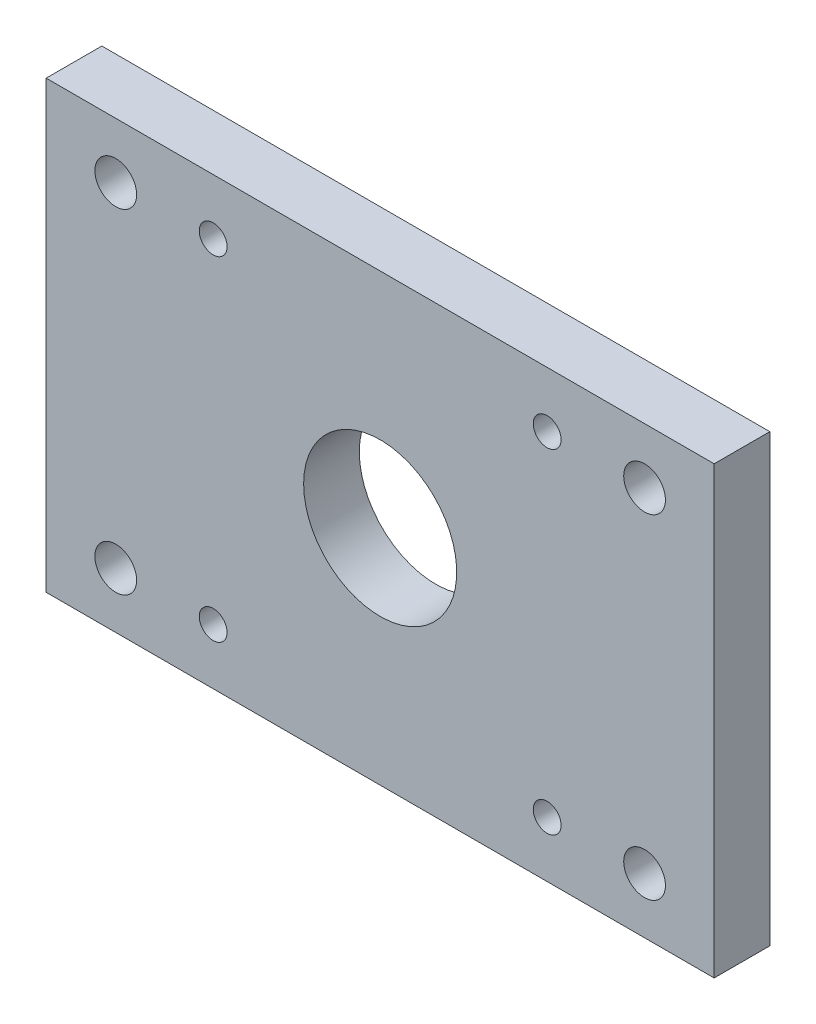
ISO-10303-21;
HEADER;
FILE_DESCRIPTION(('STEP AP214'),'2;1');
FILE_NAME('part.step','',(''),(''),'','','');
FILE_SCHEMA(('AUTOMOTIVE_DESIGN { 1 0 10303 214 1 1 1 1 }'));
ENDSEC;
DATA;
#1=APPLICATION_CONTEXT('core data for automotive mechanical design processes');
#2=APPLICATION_PROTOCOL_DEFINITION('international standard','automotive_design',2000,#1);
#3=PRODUCT_CONTEXT('',#1,'mechanical');
#4=PRODUCT('Part','Part','',(#3));
#5=PRODUCT_RELATED_PRODUCT_CATEGORY('part','',(#4));
#6=PRODUCT_DEFINITION_FORMATION('','',#4);
#7=PRODUCT_DEFINITION_CONTEXT('part definition',#1,'design');
#8=PRODUCT_DEFINITION('design','',#6,#7);
#9=PRODUCT_DEFINITION_SHAPE('','',#8);
#10=(LENGTH_UNIT() NAMED_UNIT(*) SI_UNIT(.MILLI.,.METRE.));
#11=(NAMED_UNIT(*) PLANE_ANGLE_UNIT() SI_UNIT($,.RADIAN.));
#12=(NAMED_UNIT(*) SI_UNIT($,.STERADIAN.) SOLID_ANGLE_UNIT());
#13=UNCERTAINTY_MEASURE_WITH_UNIT(LENGTH_MEASURE(1.E-05),#10,'distance_accuracy_value','');
#14=(GEOMETRIC_REPRESENTATION_CONTEXT(3) GLOBAL_UNCERTAINTY_ASSIGNED_CONTEXT((#13)) GLOBAL_UNIT_ASSIGNED_CONTEXT((#10,
#11,#12)) REPRESENTATION_CONTEXT('',''));
#15=CARTESIAN_POINT('',(0.,0.,0.));
#16=DIRECTION('',(0.,0.,1.));
#17=DIRECTION('',(1.,0.,0.));
#18=AXIS2_PLACEMENT_3D('',#15,#16,#17);
#19=CARTESIAN_POINT('',(0.,50.8,6.35));
#20=DIRECTION('',(0.,0.,-1.));
#21=DIRECTION('',(-1.,0.,0.));
#22=AXIS2_PLACEMENT_3D('',#19,#20,#21);
#23=PLANE('',#22);
#24=CARTESIAN_POINT('',(57.150000000001,6.35000000000008,6.35));
#25=DIRECTION('',(0.,0.,-1.));
#26=DIRECTION('',(-1.,0.,0.));
#27=AXIS2_PLACEMENT_3D('',#24,#25,#26);
#28=CIRCLE('',#27,1.5875);
#29=CARTESIAN_POINT('',(55.562500000001,6.35000000000008,6.35));
#30=VERTEX_POINT('',#29);
#31=EDGE_CURVE('E159',#30,#30,#28,.T.);
#32=ORIENTED_EDGE('',*,*,#31,.T.);
#33=EDGE_LOOP('',(#32));
#34=FACE_BOUND('',#33,.T.);
#35=CARTESIAN_POINT('',(57.150000000001,44.4500000000001,6.35));
#36=DIRECTION('',(0.,0.,-1.));
#37=DIRECTION('',(-1.,0.,0.));
#38=AXIS2_PLACEMENT_3D('',#35,#36,#37);
#39=CIRCLE('',#38,1.5875);
#40=CARTESIAN_POINT('',(55.562500000001,44.4500000000001,6.35));
#41=VERTEX_POINT('',#40);
#42=EDGE_CURVE('E153',#41,#41,#39,.T.);
#43=ORIENTED_EDGE('',*,*,#42,.T.);
#44=EDGE_LOOP('',(#43));
#45=FACE_BOUND('',#44,.T.);
#46=CARTESIAN_POINT('',(19.050000000001,6.35000000000019,6.35));
#47=DIRECTION('',(0.,0.,-1.));
#48=DIRECTION('',(-1.,0.,0.));
#49=AXIS2_PLACEMENT_3D('',#46,#47,#48);
#50=CIRCLE('',#49,1.5875);
#51=CARTESIAN_POINT('',(17.462500000001,6.35000000000019,6.35));
#52=VERTEX_POINT('',#51);
#53=EDGE_CURVE('E147',#52,#52,#50,.T.);
#54=ORIENTED_EDGE('',*,*,#53,.T.);
#55=EDGE_LOOP('',(#54));
#56=FACE_BOUND('',#55,.T.);
#57=CARTESIAN_POINT('',(19.050000000001,44.4500000000001,6.35));
#58=DIRECTION('',(0.,0.,-1.));
#59=DIRECTION('',(-1.,0.,0.));
#60=AXIS2_PLACEMENT_3D('',#57,#58,#59);
#61=CIRCLE('',#60,1.5875);
#62=CARTESIAN_POINT('',(17.462500000001,44.4500000000001,6.35));
#63=VERTEX_POINT('',#62);
#64=EDGE_CURVE('E141',#63,#63,#61,.T.);
#65=ORIENTED_EDGE('',*,*,#64,.T.);
#66=EDGE_LOOP('',(#65));
#67=FACE_BOUND('',#66,.T.);
#68=CARTESIAN_POINT('',(38.1,25.4,6.35));
#69=DIRECTION('',(0.,0.,-1.));
#70=DIRECTION('',(-1.,0.,0.));
#71=AXIS2_PLACEMENT_3D('',#68,#69,#70);
#72=CIRCLE('',#71,8.73125);
#73=CARTESIAN_POINT('',(29.36875,25.4,6.35));
#74=VERTEX_POINT('',#73);
#75=EDGE_CURVE('E135',#74,#74,#72,.T.);
#76=ORIENTED_EDGE('',*,*,#75,.T.);
#77=EDGE_LOOP('',(#76));
#78=FACE_BOUND('',#77,.T.);
#79=CARTESIAN_POINT('',(7.9375,44.45,6.35));
#80=DIRECTION('',(0.,0.,1.));
#81=DIRECTION('',(1.,0.,0.));
#82=AXIS2_PLACEMENT_3D('',#79,#80,#81);
#83=CIRCLE('',#82,2.38125);
#84=CARTESIAN_POINT('',(10.31875,44.45,6.35));
#85=VERTEX_POINT('',#84);
#86=EDGE_CURVE('E117',#85,#85,#83,.T.);
#87=ORIENTED_EDGE('',*,*,#86,.F.);
#88=EDGE_LOOP('',(#87));
#89=FACE_BOUND('',#88,.T.);
#90=CARTESIAN_POINT('',(68.2625,44.45,6.35));
#91=DIRECTION('',(0.,0.,-1.));
#92=DIRECTION('',(-1.,0.,0.));
#93=AXIS2_PLACEMENT_3D('',#90,#91,#92);
#94=CIRCLE('',#93,2.38125);
#95=CARTESIAN_POINT('',(65.88125,44.45,6.35));
#96=VERTEX_POINT('',#95);
#97=EDGE_CURVE('E102',#96,#96,#94,.T.);
#98=ORIENTED_EDGE('',*,*,#97,.T.);
#99=EDGE_LOOP('',(#98));
#100=FACE_BOUND('',#99,.T.);
#101=DIRECTION('',(0.,-1.,0.));
#102=VECTOR('',#101,1.);
#103=CARTESIAN_POINT('',(0.,0.,6.35));
#104=LINE('',#103,#102);
#105=CARTESIAN_POINT('',(0.,50.8,6.35));
#106=VERTEX_POINT('',#105);
#107=CARTESIAN_POINT('',(0.,0.,6.35));
#108=VERTEX_POINT('',#107);
#109=EDGE_CURVE('E87',#106,#108,#104,.T.);
#110=ORIENTED_EDGE('',*,*,#109,.T.);
#111=DIRECTION('',(1.,0.,0.));
#112=VECTOR('',#111,1.);
#113=CARTESIAN_POINT('',(0.,0.,6.35));
#114=LINE('',#113,#112);
#115=CARTESIAN_POINT('',(76.2,0.,6.35));
#116=VERTEX_POINT('',#115);
#117=EDGE_CURVE('E82',#108,#116,#114,.T.);
#118=ORIENTED_EDGE('',*,*,#117,.T.);
#119=DIRECTION('',(0.,1.,0.));
#120=VECTOR('',#119,1.);
#121=CARTESIAN_POINT('',(76.2,0.,6.35));
#122=LINE('',#121,#120);
#123=CARTESIAN_POINT('',(76.2,50.8,6.35));
#124=VERTEX_POINT('',#123);
#125=EDGE_CURVE('E85',#116,#124,#122,.T.);
#126=ORIENTED_EDGE('',*,*,#125,.T.);
#127=DIRECTION('',(-1.,0.,0.));
#128=VECTOR('',#127,1.);
#129=CARTESIAN_POINT('',(0.,50.8,6.35));
#130=LINE('',#129,#128);
#131=EDGE_CURVE('E52',#124,#106,#130,.T.);
#132=ORIENTED_EDGE('',*,*,#131,.T.);
#133=EDGE_LOOP('',(#110,#118,#126,#132));
#134=FACE_BOUND('',#133,.T.);
#135=CARTESIAN_POINT('',(7.9375,6.35,6.35));
#136=DIRECTION('',(0.,0.,-1.));
#137=DIRECTION('',(1.,0.,0.));
#138=AXIS2_PLACEMENT_3D('',#135,#136,#137);
#139=CIRCLE('',#138,2.38125);
#140=CARTESIAN_POINT('',(10.31875,6.35,6.35));
#141=VERTEX_POINT('',#140);
#142=EDGE_CURVE('E123',#141,#141,#139,.T.);
#143=ORIENTED_EDGE('',*,*,#142,.T.);
#144=EDGE_LOOP('',(#143));
#145=FACE_BOUND('',#144,.T.);
#146=CARTESIAN_POINT('',(68.2625,6.34999999999999,6.35));
#147=DIRECTION('',(0.,0.,1.));
#148=DIRECTION('',(-1.,0.,0.));
#149=AXIS2_PLACEMENT_3D('',#146,#147,#148);
#150=CIRCLE('',#149,2.38125);
#151=CARTESIAN_POINT('',(65.88125,6.34999999999999,6.35));
#152=VERTEX_POINT('',#151);
#153=EDGE_CURVE('E129',#152,#152,#150,.T.);
#154=ORIENTED_EDGE('',*,*,#153,.F.);
#155=EDGE_LOOP('',(#154));
#156=FACE_BOUND('',#155,.T.);
#157=ADVANCED_FACE('F35',(#34,#45,#56,#67,#78,#89,#100,#134,#145,#156),#23,.F.);
#158=CARTESIAN_POINT('',(0.,50.8,0.));
#159=DIRECTION('',(0.,0.,-1.));
#160=DIRECTION('',(-1.,0.,0.));
#161=AXIS2_PLACEMENT_3D('',#158,#159,#160);
#162=PLANE('',#161);
#163=CARTESIAN_POINT('',(57.150000000001,6.35000000000008,0.));
#164=DIRECTION('',(0.,0.,-1.));
#165=DIRECTION('',(-1.,0.,0.));
#166=AXIS2_PLACEMENT_3D('',#163,#164,#165);
#167=CIRCLE('',#166,1.5875);
#168=CARTESIAN_POINT('',(55.562500000001,6.35000000000008,0.));
#169=VERTEX_POINT('',#168);
#170=EDGE_CURVE('E162',#169,#169,#167,.T.);
#171=ORIENTED_EDGE('',*,*,#170,.F.);
#172=EDGE_LOOP('',(#171));
#173=FACE_BOUND('',#172,.T.);
#174=CARTESIAN_POINT('',(57.150000000001,44.4500000000001,0.));
#175=DIRECTION('',(0.,0.,-1.));
#176=DIRECTION('',(-1.,0.,0.));
#177=AXIS2_PLACEMENT_3D('',#174,#175,#176);
#178=CIRCLE('',#177,1.5875);
#179=CARTESIAN_POINT('',(55.562500000001,44.4500000000001,0.));
#180=VERTEX_POINT('',#179);
#181=EDGE_CURVE('E156',#180,#180,#178,.T.);
#182=ORIENTED_EDGE('',*,*,#181,.F.);
#183=EDGE_LOOP('',(#182));
#184=FACE_BOUND('',#183,.T.);
#185=CARTESIAN_POINT('',(19.050000000001,6.35000000000019,0.));
#186=DIRECTION('',(0.,0.,-1.));
#187=DIRECTION('',(-1.,0.,0.));
#188=AXIS2_PLACEMENT_3D('',#185,#186,#187);
#189=CIRCLE('',#188,1.5875);
#190=CARTESIAN_POINT('',(17.462500000001,6.35000000000019,0.));
#191=VERTEX_POINT('',#190);
#192=EDGE_CURVE('E150',#191,#191,#189,.T.);
#193=ORIENTED_EDGE('',*,*,#192,.F.);
#194=EDGE_LOOP('',(#193));
#195=FACE_BOUND('',#194,.T.);
#196=CARTESIAN_POINT('',(19.050000000001,44.4500000000001,0.));
#197=DIRECTION('',(0.,0.,-1.));
#198=DIRECTION('',(-1.,0.,0.));
#199=AXIS2_PLACEMENT_3D('',#196,#197,#198);
#200=CIRCLE('',#199,1.5875);
#201=CARTESIAN_POINT('',(17.462500000001,44.4500000000001,0.));
#202=VERTEX_POINT('',#201);
#203=EDGE_CURVE('E144',#202,#202,#200,.T.);
#204=ORIENTED_EDGE('',*,*,#203,.F.);
#205=EDGE_LOOP('',(#204));
#206=FACE_BOUND('',#205,.T.);
#207=CARTESIAN_POINT('',(38.1,25.4,0.));
#208=DIRECTION('',(0.,0.,-1.));
#209=DIRECTION('',(-1.,0.,0.));
#210=AXIS2_PLACEMENT_3D('',#207,#208,#209);
#211=CIRCLE('',#210,8.73125);
#212=CARTESIAN_POINT('',(29.36875,25.4,0.));
#213=VERTEX_POINT('',#212);
#214=EDGE_CURVE('E138',#213,#213,#211,.T.);
#215=ORIENTED_EDGE('',*,*,#214,.F.);
#216=EDGE_LOOP('',(#215));
#217=FACE_BOUND('',#216,.T.);
#218=CARTESIAN_POINT('',(7.9375,44.45,0.));
#219=DIRECTION('',(0.,0.,1.));
#220=DIRECTION('',(1.,0.,0.));
#221=AXIS2_PLACEMENT_3D('',#218,#219,#220);
#222=CIRCLE('',#221,2.38125);
#223=CARTESIAN_POINT('',(10.31875,44.45,0.));
#224=VERTEX_POINT('',#223);
#225=EDGE_CURVE('E120',#224,#224,#222,.T.);
#226=ORIENTED_EDGE('',*,*,#225,.T.);
#227=EDGE_LOOP('',(#226));
#228=FACE_BOUND('',#227,.T.);
#229=CARTESIAN_POINT('',(68.2625,44.45,0.));
#230=DIRECTION('',(0.,0.,-1.));
#231=DIRECTION('',(-1.,0.,0.));
#232=AXIS2_PLACEMENT_3D('',#229,#230,#231);
#233=CIRCLE('',#232,2.38125);
#234=CARTESIAN_POINT('',(65.88125,44.45,0.));
#235=VERTEX_POINT('',#234);
#236=EDGE_CURVE('E114',#235,#235,#233,.T.);
#237=ORIENTED_EDGE('',*,*,#236,.F.);
#238=EDGE_LOOP('',(#237));
#239=FACE_BOUND('',#238,.T.);
#240=DIRECTION('',(0.,-1.,0.));
#241=VECTOR('',#240,1.);
#242=CARTESIAN_POINT('',(0.,0.,0.));
#243=LINE('',#242,#241);
#244=CARTESIAN_POINT('',(0.,50.8,0.));
#245=VERTEX_POINT('',#244);
#246=CARTESIAN_POINT('',(0.,0.,0.));
#247=VERTEX_POINT('',#246);
#248=EDGE_CURVE('E99',#245,#247,#243,.T.);
#249=ORIENTED_EDGE('',*,*,#248,.F.);
#250=DIRECTION('',(-1.,0.,0.));
#251=VECTOR('',#250,1.);
#252=CARTESIAN_POINT('',(0.,50.8,0.));
#253=LINE('',#252,#251);
#254=CARTESIAN_POINT('',(76.2,50.8,0.));
#255=VERTEX_POINT('',#254);
#256=EDGE_CURVE('E75',#255,#245,#253,.T.);
#257=ORIENTED_EDGE('',*,*,#256,.F.);
#258=DIRECTION('',(0.,1.,0.));
#259=VECTOR('',#258,1.);
#260=CARTESIAN_POINT('',(76.2,0.,0.));
#261=LINE('',#260,#259);
#262=CARTESIAN_POINT('',(76.2,0.,0.));
#263=VERTEX_POINT('',#262);
#264=EDGE_CURVE('E69',#263,#255,#261,.T.);
#265=ORIENTED_EDGE('',*,*,#264,.F.);
#266=DIRECTION('',(1.,0.,0.));
#267=VECTOR('',#266,1.);
#268=CARTESIAN_POINT('',(0.,0.,0.));
#269=LINE('',#268,#267);
#270=EDGE_CURVE('E91',#247,#263,#269,.T.);
#271=ORIENTED_EDGE('',*,*,#270,.F.);
#272=EDGE_LOOP('',(#249,#257,#265,#271));
#273=FACE_BOUND('',#272,.T.);
#274=CARTESIAN_POINT('',(7.9375,6.35,0.));
#275=DIRECTION('',(0.,0.,-1.));
#276=DIRECTION('',(1.,0.,0.));
#277=AXIS2_PLACEMENT_3D('',#274,#275,#276);
#278=CIRCLE('',#277,2.38125);
#279=CARTESIAN_POINT('',(10.31875,6.35,0.));
#280=VERTEX_POINT('',#279);
#281=EDGE_CURVE('E126',#280,#280,#278,.T.);
#282=ORIENTED_EDGE('',*,*,#281,.F.);
#283=EDGE_LOOP('',(#282));
#284=FACE_BOUND('',#283,.T.);
#285=CARTESIAN_POINT('',(68.2625,6.34999999999999,0.));
#286=DIRECTION('',(0.,0.,1.));
#287=DIRECTION('',(-1.,0.,0.));
#288=AXIS2_PLACEMENT_3D('',#285,#286,#287);
#289=CIRCLE('',#288,2.38125);
#290=CARTESIAN_POINT('',(65.88125,6.34999999999999,0.));
#291=VERTEX_POINT('',#290);
#292=EDGE_CURVE('E132',#291,#291,#289,.T.);
#293=ORIENTED_EDGE('',*,*,#292,.T.);
#294=EDGE_LOOP('',(#293));
#295=FACE_BOUND('',#294,.T.);
#296=ADVANCED_FACE('F110',(#173,#184,#195,#206,#217,#228,#239,#273,#284,#295),#162,.T.);
#297=CARTESIAN_POINT('',(0.,0.,6.35));
#298=DIRECTION('',(1.,0.,0.));
#299=DIRECTION('',(0.,1.,0.));
#300=AXIS2_PLACEMENT_3D('',#297,#298,#299);
#301=PLANE('',#300);
#302=ORIENTED_EDGE('',*,*,#248,.T.);
#303=DIRECTION('',(0.,0.,-1.));
#304=VECTOR('',#303,1.);
#305=CARTESIAN_POINT('',(0.,0.,6.35));
#306=LINE('',#305,#304);
#307=EDGE_CURVE('E11',#108,#247,#306,.T.);
#308=ORIENTED_EDGE('',*,*,#307,.F.);
#309=ORIENTED_EDGE('',*,*,#109,.F.);
#310=DIRECTION('',(0.,0.,-1.));
#311=VECTOR('',#310,1.);
#312=CARTESIAN_POINT('',(0.,50.8,6.35));
#313=LINE('',#312,#311);
#314=EDGE_CURVE('E95',#106,#245,#313,.T.);
#315=ORIENTED_EDGE('',*,*,#314,.T.);
#316=EDGE_LOOP('',(#302,#308,#309,#315));
#317=FACE_BOUND('',#316,.T.);
#318=ADVANCED_FACE('F37',(#317),#301,.F.);
#319=CARTESIAN_POINT('',(0.,0.,6.35));
#320=DIRECTION('',(0.,1.,0.));
#321=DIRECTION('',(0.,0.,1.));
#322=AXIS2_PLACEMENT_3D('',#319,#320,#321);
#323=PLANE('',#322);
#324=ORIENTED_EDGE('',*,*,#270,.T.);
#325=DIRECTION('',(0.,0.,-1.));
#326=VECTOR('',#325,1.);
#327=CARTESIAN_POINT('',(76.2,0.,6.35));
#328=LINE('',#327,#326);
#329=EDGE_CURVE('E44',#116,#263,#328,.T.);
#330=ORIENTED_EDGE('',*,*,#329,.F.);
#331=ORIENTED_EDGE('',*,*,#117,.F.);
#332=ORIENTED_EDGE('',*,*,#307,.T.);
#333=EDGE_LOOP('',(#324,#330,#331,#332));
#334=FACE_BOUND('',#333,.T.);
#335=ADVANCED_FACE('F90',(#334),#323,.F.);
#336=CARTESIAN_POINT('',(76.2,0.,6.35));
#337=DIRECTION('',(-1.,0.,0.));
#338=DIRECTION('',(0.,-1.,0.));
#339=AXIS2_PLACEMENT_3D('',#336,#337,#338);
#340=PLANE('',#339);
#341=ORIENTED_EDGE('',*,*,#264,.T.);
#342=DIRECTION('',(0.,0.,-1.));
#343=VECTOR('',#342,1.);
#344=CARTESIAN_POINT('',(76.2,50.8,6.35));
#345=LINE('',#344,#343);
#346=EDGE_CURVE('E92',#124,#255,#345,.T.);
#347=ORIENTED_EDGE('',*,*,#346,.F.);
#348=ORIENTED_EDGE('',*,*,#125,.F.);
#349=ORIENTED_EDGE('',*,*,#329,.T.);
#350=EDGE_LOOP('',(#341,#347,#348,#349));
#351=FACE_BOUND('',#350,.T.);
#352=ADVANCED_FACE('F93',(#351),#340,.F.);
#353=CARTESIAN_POINT('',(0.,50.8,6.35));
#354=DIRECTION('',(0.,-1.,0.));
#355=DIRECTION('',(0.,0.,-1.));
#356=AXIS2_PLACEMENT_3D('',#353,#354,#355);
#357=PLANE('',#356);
#358=ORIENTED_EDGE('',*,*,#256,.T.);
#359=ORIENTED_EDGE('',*,*,#314,.F.);
#360=ORIENTED_EDGE('',*,*,#131,.F.);
#361=ORIENTED_EDGE('',*,*,#346,.T.);
#362=EDGE_LOOP('',(#358,#359,#360,#361));
#363=FACE_BOUND('',#362,.T.);
#364=ADVANCED_FACE('F107',(#363),#357,.F.);
#365=CARTESIAN_POINT('',(68.2625,44.45,6.35));
#366=DIRECTION('',(0.,0.,-1.));
#367=DIRECTION('',(-1.,0.,0.));
#368=AXIS2_PLACEMENT_3D('',#365,#366,#367);
#369=CYLINDRICAL_SURFACE('',#368,2.38125);
#370=ORIENTED_EDGE('',*,*,#97,.F.);
#371=EDGE_LOOP('',(#370));
#372=FACE_BOUND('',#371,.T.);
#373=ORIENTED_EDGE('',*,*,#236,.T.);
#374=EDGE_LOOP('',(#373));
#375=FACE_BOUND('',#374,.T.);
#376=ADVANCED_FACE('F192',(#372,#375),#369,.F.);
#377=CARTESIAN_POINT('',(7.9375,44.45,6.35));
#378=DIRECTION('',(0.,0.,-1.));
#379=DIRECTION('',(-1.,0.,0.));
#380=AXIS2_PLACEMENT_3D('',#377,#378,#379);
#381=CYLINDRICAL_SURFACE('',#380,2.38125);
#382=ORIENTED_EDGE('',*,*,#86,.T.);
#383=EDGE_LOOP('',(#382));
#384=FACE_BOUND('',#383,.T.);
#385=ORIENTED_EDGE('',*,*,#225,.F.);
#386=EDGE_LOOP('',(#385));
#387=FACE_BOUND('',#386,.T.);
#388=ADVANCED_FACE('F194',(#384,#387),#381,.F.);
#389=CARTESIAN_POINT('',(7.9375,6.35,6.35));
#390=DIRECTION('',(0.,0.,-1.));
#391=DIRECTION('',(-1.,0.,0.));
#392=AXIS2_PLACEMENT_3D('',#389,#390,#391);
#393=CYLINDRICAL_SURFACE('',#392,2.38125);
#394=ORIENTED_EDGE('',*,*,#142,.F.);
#395=EDGE_LOOP('',(#394));
#396=FACE_BOUND('',#395,.T.);
#397=ORIENTED_EDGE('',*,*,#281,.T.);
#398=EDGE_LOOP('',(#397));
#399=FACE_BOUND('',#398,.T.);
#400=ADVANCED_FACE('F201',(#396,#399),#393,.F.);
#401=CARTESIAN_POINT('',(68.2625,6.34999999999999,6.35));
#402=DIRECTION('',(0.,0.,-1.));
#403=DIRECTION('',(-1.,0.,0.));
#404=AXIS2_PLACEMENT_3D('',#401,#402,#403);
#405=CYLINDRICAL_SURFACE('',#404,2.38125);
#406=ORIENTED_EDGE('',*,*,#153,.T.);
#407=EDGE_LOOP('',(#406));
#408=FACE_BOUND('',#407,.T.);
#409=ORIENTED_EDGE('',*,*,#292,.F.);
#410=EDGE_LOOP('',(#409));
#411=FACE_BOUND('',#410,.T.);
#412=ADVANCED_FACE('F240',(#408,#411),#405,.F.);
#413=CARTESIAN_POINT('',(38.1,25.4,6.35));
#414=DIRECTION('',(0.,0.,-1.));
#415=DIRECTION('',(-1.,0.,0.));
#416=AXIS2_PLACEMENT_3D('',#413,#414,#415);
#417=CYLINDRICAL_SURFACE('',#416,8.73125);
#418=ORIENTED_EDGE('',*,*,#75,.F.);
#419=EDGE_LOOP('',(#418));
#420=FACE_BOUND('',#419,.T.);
#421=ORIENTED_EDGE('',*,*,#214,.T.);
#422=EDGE_LOOP('',(#421));
#423=FACE_BOUND('',#422,.T.);
#424=ADVANCED_FACE('F250',(#420,#423),#417,.F.);
#425=CARTESIAN_POINT('',(19.050000000001,44.4500000000001,6.35));
#426=DIRECTION('',(0.,0.,-1.));
#427=DIRECTION('',(-1.,0.,0.));
#428=AXIS2_PLACEMENT_3D('',#425,#426,#427);
#429=CYLINDRICAL_SURFACE('',#428,1.5875);
#430=ORIENTED_EDGE('',*,*,#64,.F.);
#431=EDGE_LOOP('',(#430));
#432=FACE_BOUND('',#431,.T.);
#433=ORIENTED_EDGE('',*,*,#203,.T.);
#434=EDGE_LOOP('',(#433));
#435=FACE_BOUND('',#434,.T.);
#436=ADVANCED_FACE('F258',(#432,#435),#429,.F.);
#437=CARTESIAN_POINT('',(19.050000000001,6.35000000000019,6.35));
#438=DIRECTION('',(0.,0.,-1.));
#439=DIRECTION('',(-1.,0.,0.));
#440=AXIS2_PLACEMENT_3D('',#437,#438,#439);
#441=CYLINDRICAL_SURFACE('',#440,1.5875);
#442=ORIENTED_EDGE('',*,*,#53,.F.);
#443=EDGE_LOOP('',(#442));
#444=FACE_BOUND('',#443,.T.);
#445=ORIENTED_EDGE('',*,*,#192,.T.);
#446=EDGE_LOOP('',(#445));
#447=FACE_BOUND('',#446,.T.);
#448=ADVANCED_FACE('F266',(#444,#447),#441,.F.);
#449=CARTESIAN_POINT('',(57.150000000001,44.4500000000001,6.35));
#450=DIRECTION('',(0.,0.,-1.));
#451=DIRECTION('',(-1.,0.,0.));
#452=AXIS2_PLACEMENT_3D('',#449,#450,#451);
#453=CYLINDRICAL_SURFACE('',#452,1.5875);
#454=ORIENTED_EDGE('',*,*,#42,.F.);
#455=EDGE_LOOP('',(#454));
#456=FACE_BOUND('',#455,.T.);
#457=ORIENTED_EDGE('',*,*,#181,.T.);
#458=EDGE_LOOP('',(#457));
#459=FACE_BOUND('',#458,.T.);
#460=ADVANCED_FACE('F173',(#456,#459),#453,.F.);
#461=CARTESIAN_POINT('',(57.150000000001,6.35000000000008,6.35));
#462=DIRECTION('',(0.,0.,-1.));
#463=DIRECTION('',(-1.,0.,0.));
#464=AXIS2_PLACEMENT_3D('',#461,#462,#463);
#465=CYLINDRICAL_SURFACE('',#464,1.5875);
#466=ORIENTED_EDGE('',*,*,#31,.F.);
#467=EDGE_LOOP('',(#466));
#468=FACE_BOUND('',#467,.T.);
#469=ORIENTED_EDGE('',*,*,#170,.T.);
#470=EDGE_LOOP('',(#469));
#471=FACE_BOUND('',#470,.T.);
#472=ADVANCED_FACE('F170',(#468,#471),#465,.F.);
#473=CLOSED_SHELL('',(#157,#296,#318,#335,#352,#364,#376,#388,#400,#412,#424,#436,#448,#460,#472));
#474=MANIFOLD_SOLID_BREP('B2',#473);
#475=ADVANCED_BREP_SHAPE_REPRESENTATION('',(#18,#474),#14);
#476=SHAPE_DEFINITION_REPRESENTATION(#9,#475);
ENDSEC;
END-ISO-10303-21;
